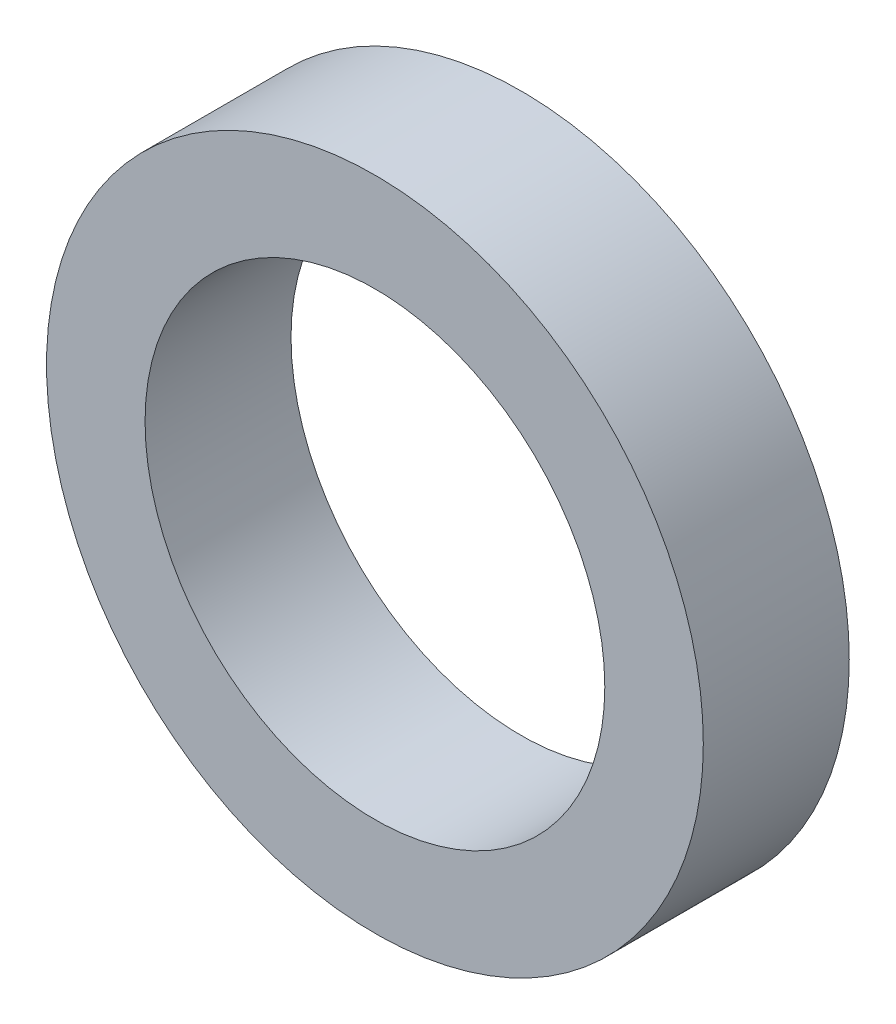
ISO-10303-21;
HEADER;
FILE_DESCRIPTION(('STEP AP214'),'2;1');
FILE_NAME('part.step','',(''),(''),'','','');
FILE_SCHEMA(('AUTOMOTIVE_DESIGN { 1 0 10303 214 1 1 1 1 }'));
ENDSEC;
DATA;
#1=APPLICATION_CONTEXT('core data for automotive mechanical design processes');
#2=APPLICATION_PROTOCOL_DEFINITION('international standard','automotive_design',2000,#1);
#3=PRODUCT_CONTEXT('',#1,'mechanical');
#4=PRODUCT('Part','Part','',(#3));
#5=PRODUCT_RELATED_PRODUCT_CATEGORY('part','',(#4));
#6=PRODUCT_DEFINITION_FORMATION('','',#4);
#7=PRODUCT_DEFINITION_CONTEXT('part definition',#1,'design');
#8=PRODUCT_DEFINITION('design','',#6,#7);
#9=PRODUCT_DEFINITION_SHAPE('','',#8);
#10=(LENGTH_UNIT() NAMED_UNIT(*) SI_UNIT(.MILLI.,.METRE.));
#11=(NAMED_UNIT(*) PLANE_ANGLE_UNIT() SI_UNIT($,.RADIAN.));
#12=(NAMED_UNIT(*) SI_UNIT($,.STERADIAN.) SOLID_ANGLE_UNIT());
#13=UNCERTAINTY_MEASURE_WITH_UNIT(LENGTH_MEASURE(1.E-05),#10,'distance_accuracy_value','');
#14=(GEOMETRIC_REPRESENTATION_CONTEXT(3) GLOBAL_UNCERTAINTY_ASSIGNED_CONTEXT((#13)) GLOBAL_UNIT_ASSIGNED_CONTEXT((#10,
#11,#12)) REPRESENTATION_CONTEXT('',''));
#15=CARTESIAN_POINT('',(0.,0.,0.));
#16=DIRECTION('',(0.,0.,1.));
#17=DIRECTION('',(1.,0.,0.));
#18=AXIS2_PLACEMENT_3D('',#15,#16,#17);
#19=CARTESIAN_POINT('',(0.,0.,10.));
#20=DIRECTION('',(0.,0.,1.));
#21=DIRECTION('',(1.,0.,0.));
#22=AXIS2_PLACEMENT_3D('',#19,#20,#21);
#23=PLANE('',#22);
#24=CARTESIAN_POINT('',(0.,0.,10.));
#25=DIRECTION('',(0.,0.,1.));
#26=DIRECTION('',(1.,0.,0.));
#27=AXIS2_PLACEMENT_3D('',#24,#25,#26);
#28=CIRCLE('',#27,22.5);
#29=CARTESIAN_POINT('',(22.5,0.,10.));
#30=VERTEX_POINT('',#29);
#31=EDGE_CURVE('E10',#30,#30,#28,.T.);
#32=ORIENTED_EDGE('',*,*,#31,.T.);
#33=EDGE_LOOP('',(#32));
#34=FACE_BOUND('',#33,.T.);
#35=CARTESIAN_POINT('',(0.,0.,10.));
#36=DIRECTION('',(0.,0.,1.));
#37=DIRECTION('',(1.,0.,0.));
#38=AXIS2_PLACEMENT_3D('',#35,#36,#37);
#39=CIRCLE('',#38,15.75);
#40=CARTESIAN_POINT('',(15.75,0.,10.));
#41=VERTEX_POINT('',#40);
#42=EDGE_CURVE('E47',#41,#41,#39,.T.);
#43=ORIENTED_EDGE('',*,*,#42,.F.);
#44=EDGE_LOOP('',(#43));
#45=FACE_BOUND('',#44,.T.);
#46=ADVANCED_FACE('F36',(#34,#45),#23,.T.);
#47=CARTESIAN_POINT('',(0.,0.,0.));
#48=DIRECTION('',(0.,0.,1.));
#49=DIRECTION('',(1.,0.,0.));
#50=AXIS2_PLACEMENT_3D('',#47,#48,#49);
#51=PLANE('',#50);
#52=CARTESIAN_POINT('',(0.,0.,0.));
#53=DIRECTION('',(0.,0.,1.));
#54=DIRECTION('',(1.,0.,0.));
#55=AXIS2_PLACEMENT_3D('',#52,#53,#54);
#56=CIRCLE('',#55,22.5);
#57=CARTESIAN_POINT('',(22.5,0.,0.));
#58=VERTEX_POINT('',#57);
#59=EDGE_CURVE('E40',#58,#58,#56,.T.);
#60=ORIENTED_EDGE('',*,*,#59,.F.);
#61=EDGE_LOOP('',(#60));
#62=FACE_BOUND('',#61,.T.);
#63=CARTESIAN_POINT('',(0.,0.,0.));
#64=DIRECTION('',(0.,0.,1.));
#65=DIRECTION('',(1.,0.,0.));
#66=AXIS2_PLACEMENT_3D('',#63,#64,#65);
#67=CIRCLE('',#66,15.75);
#68=CARTESIAN_POINT('',(15.75,0.,0.));
#69=VERTEX_POINT('',#68);
#70=EDGE_CURVE('E49',#69,#69,#67,.T.);
#71=ORIENTED_EDGE('',*,*,#70,.T.);
#72=EDGE_LOOP('',(#71));
#73=FACE_BOUND('',#72,.T.);
#74=ADVANCED_FACE('F59',(#62,#73),#51,.F.);
#75=CARTESIAN_POINT('',(0.,0.,10.));
#76=DIRECTION('',(0.,0.,-1.));
#77=DIRECTION('',(-1.,0.,0.));
#78=AXIS2_PLACEMENT_3D('',#75,#76,#77);
#79=CYLINDRICAL_SURFACE('',#78,22.5);
#80=ORIENTED_EDGE('',*,*,#31,.F.);
#81=EDGE_LOOP('',(#80));
#82=FACE_BOUND('',#81,.T.);
#83=ORIENTED_EDGE('',*,*,#59,.T.);
#84=EDGE_LOOP('',(#83));
#85=FACE_BOUND('',#84,.T.);
#86=ADVANCED_FACE('F38',(#82,#85),#79,.T.);
#87=CARTESIAN_POINT('',(0.,0.,10.));
#88=DIRECTION('',(0.,0.,-1.));
#89=DIRECTION('',(-1.,0.,0.));
#90=AXIS2_PLACEMENT_3D('',#87,#88,#89);
#91=CYLINDRICAL_SURFACE('',#90,15.75);
#92=ORIENTED_EDGE('',*,*,#42,.T.);
#93=EDGE_LOOP('',(#92));
#94=FACE_BOUND('',#93,.T.);
#95=ORIENTED_EDGE('',*,*,#70,.F.);
#96=EDGE_LOOP('',(#95));
#97=FACE_BOUND('',#96,.T.);
#98=ADVANCED_FACE('F55',(#94,#97),#91,.F.);
#99=CLOSED_SHELL('',(#46,#74,#86,#98));
#100=MANIFOLD_SOLID_BREP('B2',#99);
#101=ADVANCED_BREP_SHAPE_REPRESENTATION('',(#18,#100),#14);
#102=SHAPE_DEFINITION_REPRESENTATION(#9,#101);
ENDSEC;
END-ISO-10303-21;
